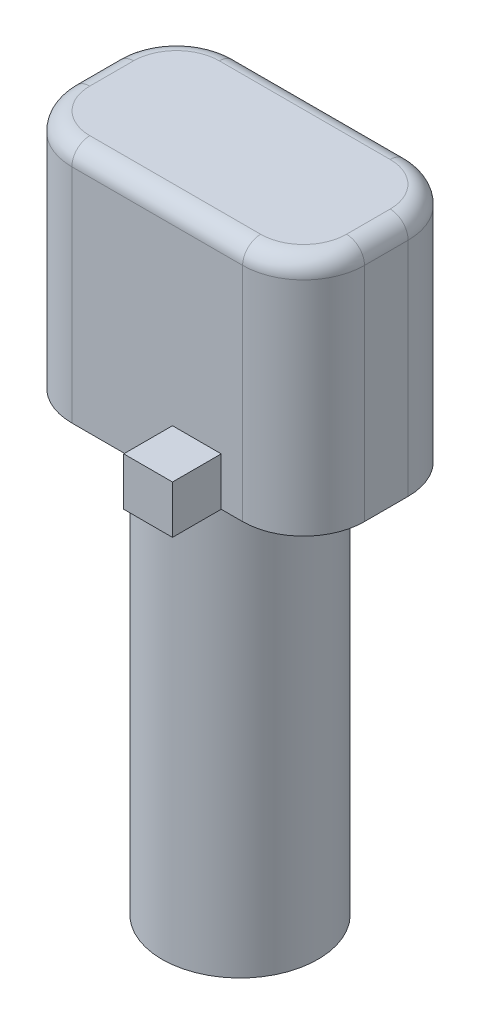
ISO-10303-21;
HEADER;
FILE_DESCRIPTION(('STEP AP214'),'2;1');
FILE_NAME('part.step','',(''),(''),'','','');
FILE_SCHEMA(('AUTOMOTIVE_DESIGN { 1 0 10303 214 1 1 1 1 }'));
ENDSEC;
DATA;
#1=APPLICATION_CONTEXT('core data for automotive mechanical design processes');
#2=APPLICATION_PROTOCOL_DEFINITION('international standard','automotive_design',2000,#1);
#3=PRODUCT_CONTEXT('',#1,'mechanical');
#4=PRODUCT('Part','Part','',(#3));
#5=PRODUCT_RELATED_PRODUCT_CATEGORY('part','',(#4));
#6=PRODUCT_DEFINITION_FORMATION('','',#4);
#7=PRODUCT_DEFINITION_CONTEXT('part definition',#1,'design');
#8=PRODUCT_DEFINITION('design','',#6,#7);
#9=PRODUCT_DEFINITION_SHAPE('','',#8);
#10=(LENGTH_UNIT() NAMED_UNIT(*) SI_UNIT(.MILLI.,.METRE.));
#11=(NAMED_UNIT(*) PLANE_ANGLE_UNIT() SI_UNIT($,.RADIAN.));
#12=(NAMED_UNIT(*) SI_UNIT($,.STERADIAN.) SOLID_ANGLE_UNIT());
#13=UNCERTAINTY_MEASURE_WITH_UNIT(LENGTH_MEASURE(1.E-05),#10,'distance_accuracy_value','');
#14=(GEOMETRIC_REPRESENTATION_CONTEXT(3) GLOBAL_UNCERTAINTY_ASSIGNED_CONTEXT((#13)) GLOBAL_UNIT_ASSIGNED_CONTEXT((#10,
#11,#12)) REPRESENTATION_CONTEXT('',''));
#15=CARTESIAN_POINT('',(0.,0.,0.));
#16=DIRECTION('',(0.,0.,1.));
#17=DIRECTION('',(1.,0.,0.));
#18=AXIS2_PLACEMENT_3D('',#15,#16,#17);
#19=CARTESIAN_POINT('',(0.,17.686,0.));
#20=DIRECTION('',(0.,-1.,0.));
#21=DIRECTION('',(0.,0.,-1.));
#22=AXIS2_PLACEMENT_3D('',#19,#20,#21);
#23=CYLINDRICAL_SURFACE('',#22,3.25);
#24=CARTESIAN_POINT('',(0.,17.686,0.));
#25=DIRECTION('',(0.,1.,0.));
#26=DIRECTION('',(0.,0.,1.));
#27=AXIS2_PLACEMENT_3D('',#24,#25,#26);
#28=CIRCLE('',#27,3.25);
#29=CARTESIAN_POINT('',(0.,17.686,3.25));
#30=VERTEX_POINT('',#29);
#31=EDGE_CURVE('E290',#30,#30,#28,.T.);
#32=ORIENTED_EDGE('',*,*,#31,.F.);
#33=EDGE_LOOP('',(#32));
#34=FACE_BOUND('',#33,.T.);
#35=CARTESIAN_POINT('',(0.,0.,0.));
#36=DIRECTION('',(0.,1.,0.));
#37=DIRECTION('',(0.,0.,1.));
#38=AXIS2_PLACEMENT_3D('',#35,#36,#37);
#39=CIRCLE('',#38,3.25);
#40=CARTESIAN_POINT('',(0.,0.,3.25));
#41=VERTEX_POINT('',#40);
#42=EDGE_CURVE('E289',#41,#41,#39,.T.);
#43=ORIENTED_EDGE('',*,*,#42,.T.);
#44=EDGE_LOOP('',(#43));
#45=FACE_BOUND('',#44,.T.);
#46=ADVANCED_FACE('F47',(#34,#45),#23,.T.);
#47=CARTESIAN_POINT('',(0.,0.,0.));
#48=DIRECTION('',(0.,1.,0.));
#49=DIRECTION('',(0.,0.,1.));
#50=AXIS2_PLACEMENT_3D('',#47,#48,#49);
#51=PLANE('',#50);
#52=ORIENTED_EDGE('',*,*,#42,.F.);
#53=EDGE_LOOP('',(#52));
#54=FACE_BOUND('',#53,.T.);
#55=ADVANCED_FACE('F501',(#54),#51,.F.);
#56=CARTESIAN_POINT('',(6.1,27.686,-3.45));
#57=DIRECTION('',(-1.,0.,0.));
#58=DIRECTION('',(0.,0.,1.));
#59=AXIS2_PLACEMENT_3D('',#56,#57,#58);
#60=PLANE('',#59);
#61=DIRECTION('',(0.,-1.,0.));
#62=VECTOR('',#61,1.);
#63=CARTESIAN_POINT('',(6.1,27.686,-0.909999999999999));
#64=LINE('',#63,#62);
#65=CARTESIAN_POINT('',(6.1,17.686,-0.909999999999999));
#66=VERTEX_POINT('',#65);
#67=CARTESIAN_POINT('',(6.1,26.936,-0.909999999999999));
#68=VERTEX_POINT('',#67);
#69=EDGE_CURVE('E328',#66,#68,#64,.F.);
#70=ORIENTED_EDGE('',*,*,#69,.T.);
#71=DIRECTION('',(0.,0.,-1.));
#72=VECTOR('',#71,1.);
#73=CARTESIAN_POINT('',(6.1,26.936,0.910000000000001));
#74=LINE('',#73,#72);
#75=CARTESIAN_POINT('',(6.1,26.936,0.910000000000001));
#76=VERTEX_POINT('',#75);
#77=EDGE_CURVE('E364',#68,#76,#74,.F.);
#78=ORIENTED_EDGE('',*,*,#77,.T.);
#79=DIRECTION('',(0.,-1.,0.));
#80=VECTOR('',#79,1.);
#81=CARTESIAN_POINT('',(6.1,27.686,0.910000000000001));
#82=LINE('',#81,#80);
#83=CARTESIAN_POINT('',(6.1,17.686,0.910000000000001));
#84=VERTEX_POINT('',#83);
#85=EDGE_CURVE('E325',#76,#84,#82,.T.);
#86=ORIENTED_EDGE('',*,*,#85,.T.);
#87=DIRECTION('',(0.,0.,-1.));
#88=VECTOR('',#87,1.);
#89=CARTESIAN_POINT('',(6.1,17.686,-3.45));
#90=LINE('',#89,#88);
#91=EDGE_CURVE('E273',#84,#66,#90,.T.);
#92=ORIENTED_EDGE('',*,*,#91,.T.);
#93=EDGE_LOOP('',(#70,#78,#86,#92));
#94=FACE_BOUND('',#93,.T.);
#95=ADVANCED_FACE('F483',(#94),#60,.F.);
#96=CARTESIAN_POINT('',(-6.1,27.686,-3.45));
#97=DIRECTION('',(0.,0.,1.));
#98=DIRECTION('',(1.,0.,0.));
#99=AXIS2_PLACEMENT_3D('',#96,#97,#98);
#100=PLANE('',#99);
#101=DIRECTION('',(-1.,0.,0.));
#102=VECTOR('',#101,1.);
#103=CARTESIAN_POINT('',(-3.302,19.686,-3.45));
#104=LINE('',#103,#102);
#105=CARTESIAN_POINT('',(-1.27,19.686,-3.45));
#106=VERTEX_POINT('',#105);
#107=CARTESIAN_POINT('',(-3.302,19.686,-3.45));
#108=VERTEX_POINT('',#107);
#109=EDGE_CURVE('E65',#106,#108,#104,.T.);
#110=ORIENTED_EDGE('',*,*,#109,.T.);
#111=DIRECTION('',(0.,-1.,0.));
#112=VECTOR('',#111,1.);
#113=CARTESIAN_POINT('',(-3.302,19.686,-3.45));
#114=LINE('',#113,#112);
#115=CARTESIAN_POINT('',(-3.302,17.686,-3.45));
#116=VERTEX_POINT('',#115);
#117=EDGE_CURVE('E208',#108,#116,#114,.T.);
#118=ORIENTED_EDGE('',*,*,#117,.T.);
#119=DIRECTION('',(-1.,0.,0.));
#120=VECTOR('',#119,1.);
#121=CARTESIAN_POINT('',(-6.1,17.686,-3.45));
#122=LINE('',#121,#120);
#123=CARTESIAN_POINT('',(-3.56,17.686,-3.45));
#124=VERTEX_POINT('',#123);
#125=EDGE_CURVE('E277',#116,#124,#122,.T.);
#126=ORIENTED_EDGE('',*,*,#125,.T.);
#127=DIRECTION('',(0.,-1.,0.));
#128=VECTOR('',#127,1.);
#129=CARTESIAN_POINT('',(-3.56,27.686,-3.45));
#130=LINE('',#129,#128);
#131=CARTESIAN_POINT('',(-3.56,26.936,-3.45));
#132=VERTEX_POINT('',#131);
#133=EDGE_CURVE('E321',#124,#132,#130,.F.);
#134=ORIENTED_EDGE('',*,*,#133,.T.);
#135=DIRECTION('',(-1.,0.,0.));
#136=VECTOR('',#135,1.);
#137=CARTESIAN_POINT('',(3.56,26.936,-3.45));
#138=LINE('',#137,#136);
#139=CARTESIAN_POINT('',(3.56,26.936,-3.45));
#140=VERTEX_POINT('',#139);
#141=EDGE_CURVE('E374',#132,#140,#138,.F.);
#142=ORIENTED_EDGE('',*,*,#141,.T.);
#143=DIRECTION('',(0.,-1.,0.));
#144=VECTOR('',#143,1.);
#145=CARTESIAN_POINT('',(3.56,27.686,-3.45));
#146=LINE('',#145,#144);
#147=CARTESIAN_POINT('',(3.56,17.686,-3.45));
#148=VERTEX_POINT('',#147);
#149=EDGE_CURVE('E318',#140,#148,#146,.T.);
#150=ORIENTED_EDGE('',*,*,#149,.T.);
#151=CARTESIAN_POINT('',(-1.27,17.686,-3.45));
#152=VERTEX_POINT('',#151);
#153=EDGE_CURVE('E278',#148,#152,#122,.T.);
#154=ORIENTED_EDGE('',*,*,#153,.T.);
#155=DIRECTION('',(0.,-1.,0.));
#156=VECTOR('',#155,1.);
#157=CARTESIAN_POINT('',(-1.27,19.686,-3.45));
#158=LINE('',#157,#156);
#159=EDGE_CURVE('E70',#106,#152,#158,.T.);
#160=ORIENTED_EDGE('',*,*,#159,.F.);
#161=EDGE_LOOP('',(#110,#118,#126,#134,#142,#150,#154,#160));
#162=FACE_BOUND('',#161,.T.);
#163=ADVANCED_FACE('F464',(#162),#100,.F.);
#164=CARTESIAN_POINT('',(-6.1,27.686,-3.45));
#165=DIRECTION('',(1.,0.,0.));
#166=DIRECTION('',(0.,0.,-1.));
#167=AXIS2_PLACEMENT_3D('',#164,#165,#166);
#168=PLANE('',#167);
#169=DIRECTION('',(0.,-1.,0.));
#170=VECTOR('',#169,1.);
#171=CARTESIAN_POINT('',(-6.1,27.686,0.910000000000001));
#172=LINE('',#171,#170);
#173=CARTESIAN_POINT('',(-6.1,17.686,0.910000000000001));
#174=VERTEX_POINT('',#173);
#175=CARTESIAN_POINT('',(-6.1,26.936,0.910000000000001));
#176=VERTEX_POINT('',#175);
#177=EDGE_CURVE('E294',#174,#176,#172,.F.);
#178=ORIENTED_EDGE('',*,*,#177,.T.);
#179=DIRECTION('',(0.,0.,1.));
#180=VECTOR('',#179,1.);
#181=CARTESIAN_POINT('',(-6.1,26.936,-0.909999999999998));
#182=LINE('',#181,#180);
#183=CARTESIAN_POINT('',(-6.1,26.936,-0.909999999999998));
#184=VERTEX_POINT('',#183);
#185=EDGE_CURVE('E380',#176,#184,#182,.F.);
#186=ORIENTED_EDGE('',*,*,#185,.T.);
#187=DIRECTION('',(0.,-1.,0.));
#188=VECTOR('',#187,1.);
#189=CARTESIAN_POINT('',(-6.1,27.686,-0.909999999999998));
#190=LINE('',#189,#188);
#191=CARTESIAN_POINT('',(-6.1,17.686,-0.909999999999998));
#192=VERTEX_POINT('',#191);
#193=EDGE_CURVE('E301',#184,#192,#190,.T.);
#194=ORIENTED_EDGE('',*,*,#193,.T.);
#195=DIRECTION('',(0.,0.,1.));
#196=VECTOR('',#195,1.);
#197=CARTESIAN_POINT('',(-6.1,17.686,-3.45));
#198=LINE('',#197,#196);
#199=EDGE_CURVE('E281',#192,#174,#198,.T.);
#200=ORIENTED_EDGE('',*,*,#199,.T.);
#201=EDGE_LOOP('',(#178,#186,#194,#200));
#202=FACE_BOUND('',#201,.T.);
#203=ADVANCED_FACE('F425',(#202),#168,.F.);
#204=CARTESIAN_POINT('',(-6.1,27.686,3.45));
#205=DIRECTION('',(0.,0.,-1.));
#206=DIRECTION('',(-1.,0.,0.));
#207=AXIS2_PLACEMENT_3D('',#204,#205,#206);
#208=PLANE('',#207);
#209=DIRECTION('',(1.,0.,0.));
#210=VECTOR('',#209,1.);
#211=CARTESIAN_POINT('',(2.667,19.686,3.45));
#212=LINE('',#211,#210);
#213=CARTESIAN_POINT('',(0.634999999999998,19.686,3.45));
#214=VERTEX_POINT('',#213);
#215=CARTESIAN_POINT('',(2.667,19.686,3.45));
#216=VERTEX_POINT('',#215);
#217=EDGE_CURVE('E236',#214,#216,#212,.T.);
#218=ORIENTED_EDGE('',*,*,#217,.T.);
#219=DIRECTION('',(0.,-1.,0.));
#220=VECTOR('',#219,1.);
#221=CARTESIAN_POINT('',(2.667,19.686,3.45));
#222=LINE('',#221,#220);
#223=CARTESIAN_POINT('',(2.667,17.686,3.45));
#224=VERTEX_POINT('',#223);
#225=EDGE_CURVE('E244',#216,#224,#222,.T.);
#226=ORIENTED_EDGE('',*,*,#225,.T.);
#227=DIRECTION('',(1.,0.,0.));
#228=VECTOR('',#227,1.);
#229=CARTESIAN_POINT('',(-6.1,17.686,3.45));
#230=LINE('',#229,#228);
#231=CARTESIAN_POINT('',(3.56,17.686,3.45));
#232=VERTEX_POINT('',#231);
#233=EDGE_CURVE('E285',#224,#232,#230,.T.);
#234=ORIENTED_EDGE('',*,*,#233,.T.);
#235=DIRECTION('',(0.,-1.,0.));
#236=VECTOR('',#235,1.);
#237=CARTESIAN_POINT('',(3.56,27.686,3.45));
#238=LINE('',#237,#236);
#239=CARTESIAN_POINT('',(3.56,26.936,3.45));
#240=VERTEX_POINT('',#239);
#241=EDGE_CURVE('E335',#232,#240,#238,.F.);
#242=ORIENTED_EDGE('',*,*,#241,.T.);
#243=DIRECTION('',(1.,0.,0.));
#244=VECTOR('',#243,1.);
#245=CARTESIAN_POINT('',(-3.56,26.936,3.45));
#246=LINE('',#245,#244);
#247=CARTESIAN_POINT('',(-3.56,26.936,3.45));
#248=VERTEX_POINT('',#247);
#249=EDGE_CURVE('E11',#240,#248,#246,.F.);
#250=ORIENTED_EDGE('',*,*,#249,.T.);
#251=DIRECTION('',(0.,-1.,0.));
#252=VECTOR('',#251,1.);
#253=CARTESIAN_POINT('',(-3.56,27.686,3.45));
#254=LINE('',#253,#252);
#255=CARTESIAN_POINT('',(-3.56,17.686,3.45));
#256=VERTEX_POINT('',#255);
#257=EDGE_CURVE('E332',#248,#256,#254,.T.);
#258=ORIENTED_EDGE('',*,*,#257,.T.);
#259=CARTESIAN_POINT('',(0.634999999999999,17.686,3.45));
#260=VERTEX_POINT('',#259);
#261=EDGE_CURVE('E286',#256,#260,#230,.T.);
#262=ORIENTED_EDGE('',*,*,#261,.T.);
#263=DIRECTION('',(0.,-1.,0.));
#264=VECTOR('',#263,1.);
#265=CARTESIAN_POINT('',(0.634999999999999,19.686,3.45));
#266=LINE('',#265,#264);
#267=EDGE_CURVE('E240',#214,#260,#266,.T.);
#268=ORIENTED_EDGE('',*,*,#267,.F.);
#269=EDGE_LOOP('',(#218,#226,#234,#242,#250,#258,#262,#268));
#270=FACE_BOUND('',#269,.T.);
#271=ADVANCED_FACE('F440',(#270),#208,.F.);
#272=CARTESIAN_POINT('',(0.,27.686,0.));
#273=DIRECTION('',(0.,1.,0.));
#274=DIRECTION('',(0.,0.,1.));
#275=AXIS2_PLACEMENT_3D('',#272,#273,#274);
#276=PLANE('',#275);
#277=CARTESIAN_POINT('',(3.56,27.686,0.910000000000001));
#278=DIRECTION('',(0.,1.,0.));
#279=DIRECTION('',(0.,0.,1.));
#280=AXIS2_PLACEMENT_3D('',#277,#278,#279);
#281=CIRCLE('',#280,1.79);
#282=CARTESIAN_POINT('',(3.56,27.686,2.7));
#283=VERTEX_POINT('',#282);
#284=CARTESIAN_POINT('',(5.35,27.686,0.910000000000001));
#285=VERTEX_POINT('',#284);
#286=EDGE_CURVE('E357',#283,#285,#281,.T.);
#287=ORIENTED_EDGE('',*,*,#286,.T.);
#288=DIRECTION('',(0.,0.,-1.));
#289=VECTOR('',#288,1.);
#290=CARTESIAN_POINT('',(5.35,27.686,-0.909999999999999));
#291=LINE('',#290,#289);
#292=CARTESIAN_POINT('',(5.35,27.686,-0.909999999999999));
#293=VERTEX_POINT('',#292);
#294=EDGE_CURVE('E360',#285,#293,#291,.T.);
#295=ORIENTED_EDGE('',*,*,#294,.T.);
#296=CARTESIAN_POINT('',(3.56,27.686,-0.909999999999999));
#297=DIRECTION('',(0.,1.,0.));
#298=DIRECTION('',(0.,0.,1.));
#299=AXIS2_PLACEMENT_3D('',#296,#297,#298);
#300=CIRCLE('',#299,1.79);
#301=CARTESIAN_POINT('',(3.56,27.686,-2.7));
#302=VERTEX_POINT('',#301);
#303=EDGE_CURVE('E354',#293,#302,#300,.T.);
#304=ORIENTED_EDGE('',*,*,#303,.T.);
#305=DIRECTION('',(-1.,0.,0.));
#306=VECTOR('',#305,1.);
#307=CARTESIAN_POINT('',(-3.56,27.686,-2.7));
#308=LINE('',#307,#306);
#309=CARTESIAN_POINT('',(-3.56,27.686,-2.7));
#310=VERTEX_POINT('',#309);
#311=EDGE_CURVE('E351',#302,#310,#308,.T.);
#312=ORIENTED_EDGE('',*,*,#311,.T.);
#313=CARTESIAN_POINT('',(-3.56,27.686,-0.909999999999999));
#314=DIRECTION('',(0.,1.,0.));
#315=DIRECTION('',(0.,0.,1.));
#316=AXIS2_PLACEMENT_3D('',#313,#314,#315);
#317=CIRCLE('',#316,1.79);
#318=CARTESIAN_POINT('',(-5.35,27.686,-0.909999999999999));
#319=VERTEX_POINT('',#318);
#320=EDGE_CURVE('E348',#310,#319,#317,.T.);
#321=ORIENTED_EDGE('',*,*,#320,.T.);
#322=DIRECTION('',(0.,0.,1.));
#323=VECTOR('',#322,1.);
#324=CARTESIAN_POINT('',(-5.35,27.686,0.910000000000001));
#325=LINE('',#324,#323);
#326=CARTESIAN_POINT('',(-5.35,27.686,0.910000000000001));
#327=VERTEX_POINT('',#326);
#328=EDGE_CURVE('E345',#319,#327,#325,.T.);
#329=ORIENTED_EDGE('',*,*,#328,.T.);
#330=CARTESIAN_POINT('',(-3.56,27.686,0.910000000000001));
#331=DIRECTION('',(0.,1.,0.));
#332=DIRECTION('',(0.,0.,1.));
#333=AXIS2_PLACEMENT_3D('',#330,#331,#332);
#334=CIRCLE('',#333,1.79);
#335=CARTESIAN_POINT('',(-3.56,27.686,2.7));
#336=VERTEX_POINT('',#335);
#337=EDGE_CURVE('E342',#327,#336,#334,.T.);
#338=ORIENTED_EDGE('',*,*,#337,.T.);
#339=DIRECTION('',(1.,0.,0.));
#340=VECTOR('',#339,1.);
#341=CARTESIAN_POINT('',(3.56,27.686,2.7));
#342=LINE('',#341,#340);
#343=EDGE_CURVE('E339',#336,#283,#342,.T.);
#344=ORIENTED_EDGE('',*,*,#343,.T.);
#345=EDGE_LOOP('',(#287,#295,#304,#312,#321,#329,#338,#344));
#346=FACE_BOUND('',#345,.T.);
#347=ADVANCED_FACE('F454',(#346),#276,.T.);
#348=CARTESIAN_POINT('',(0.,17.686,0.));
#349=DIRECTION('',(0.,1.,0.));
#350=DIRECTION('',(0.,0.,1.));
#351=AXIS2_PLACEMENT_3D('',#348,#349,#350);
#352=PLANE('',#351);
#353=ORIENTED_EDGE('',*,*,#31,.T.);
#354=EDGE_LOOP('',(#353));
#355=FACE_BOUND('',#354,.T.);
#356=ORIENTED_EDGE('',*,*,#199,.F.);
#357=CARTESIAN_POINT('',(-3.56,17.686,-0.909999999999999));
#358=DIRECTION('',(0.,1.,0.));
#359=DIRECTION('',(0.,0.,1.));
#360=AXIS2_PLACEMENT_3D('',#357,#358,#359);
#361=CIRCLE('',#360,2.54);
#362=EDGE_CURVE('E314',#192,#124,#361,.F.);
#363=ORIENTED_EDGE('',*,*,#362,.T.);
#364=ORIENTED_EDGE('',*,*,#125,.F.);
#365=DIRECTION('',(0.,0.,-1.));
#366=VECTOR('',#365,1.);
#367=CARTESIAN_POINT('',(-3.302,17.686,-5.482));
#368=LINE('',#367,#366);
#369=CARTESIAN_POINT('',(-3.302,17.686,-5.482));
#370=VERTEX_POINT('',#369);
#371=EDGE_CURVE('E220',#116,#370,#368,.T.);
#372=ORIENTED_EDGE('',*,*,#371,.T.);
#373=DIRECTION('',(1.,0.,0.));
#374=VECTOR('',#373,1.);
#375=CARTESIAN_POINT('',(-1.27,17.686,-5.482));
#376=LINE('',#375,#374);
#377=CARTESIAN_POINT('',(-1.27,17.686,-5.482));
#378=VERTEX_POINT('',#377);
#379=EDGE_CURVE('E191',#370,#378,#376,.T.);
#380=ORIENTED_EDGE('',*,*,#379,.T.);
#381=DIRECTION('',(0.,0.,1.));
#382=VECTOR('',#381,1.);
#383=CARTESIAN_POINT('',(-1.27,17.686,-3.45));
#384=LINE('',#383,#382);
#385=EDGE_CURVE('E210',#378,#152,#384,.T.);
#386=ORIENTED_EDGE('',*,*,#385,.T.);
#387=ORIENTED_EDGE('',*,*,#153,.F.);
#388=CARTESIAN_POINT('',(3.56,17.686,-0.909999999999999));
#389=DIRECTION('',(0.,1.,0.));
#390=DIRECTION('',(0.,0.,1.));
#391=AXIS2_PLACEMENT_3D('',#388,#389,#390);
#392=CIRCLE('',#391,2.54);
#393=EDGE_CURVE('E311',#148,#66,#392,.F.);
#394=ORIENTED_EDGE('',*,*,#393,.T.);
#395=ORIENTED_EDGE('',*,*,#91,.F.);
#396=CARTESIAN_POINT('',(3.56,17.686,0.910000000000001));
#397=DIRECTION('',(0.,1.,0.));
#398=DIRECTION('',(0.,0.,1.));
#399=AXIS2_PLACEMENT_3D('',#396,#397,#398);
#400=CIRCLE('',#399,2.54);
#401=EDGE_CURVE('E307',#84,#232,#400,.F.);
#402=ORIENTED_EDGE('',*,*,#401,.T.);
#403=ORIENTED_EDGE('',*,*,#233,.F.);
#404=DIRECTION('',(0.,0.,1.));
#405=VECTOR('',#404,1.);
#406=CARTESIAN_POINT('',(2.667,17.686,3.45));
#407=LINE('',#406,#405);
#408=CARTESIAN_POINT('',(2.667,17.686,5.482));
#409=VERTEX_POINT('',#408);
#410=EDGE_CURVE('E223',#224,#409,#407,.T.);
#411=ORIENTED_EDGE('',*,*,#410,.T.);
#412=DIRECTION('',(-1.,0.,0.));
#413=VECTOR('',#412,1.);
#414=CARTESIAN_POINT('',(2.667,17.686,5.482));
#415=LINE('',#414,#413);
#416=CARTESIAN_POINT('',(0.634999999999999,17.686,5.482));
#417=VERTEX_POINT('',#416);
#418=EDGE_CURVE('E252',#409,#417,#415,.T.);
#419=ORIENTED_EDGE('',*,*,#418,.T.);
#420=DIRECTION('',(0.,0.,-1.));
#421=VECTOR('',#420,1.);
#422=CARTESIAN_POINT('',(0.634999999999999,17.686,5.482));
#423=LINE('',#422,#421);
#424=EDGE_CURVE('E248',#417,#260,#423,.T.);
#425=ORIENTED_EDGE('',*,*,#424,.T.);
#426=ORIENTED_EDGE('',*,*,#261,.F.);
#427=CARTESIAN_POINT('',(-3.56,17.686,0.910000000000001));
#428=DIRECTION('',(0.,1.,0.));
#429=DIRECTION('',(0.,0.,1.));
#430=AXIS2_PLACEMENT_3D('',#427,#428,#429);
#431=CIRCLE('',#430,2.54);
#432=EDGE_CURVE('E304',#256,#174,#431,.F.);
#433=ORIENTED_EDGE('',*,*,#432,.T.);
#434=EDGE_LOOP('',(#356,#363,#364,#372,#380,#386,#387,#394,#395,#402,#403,#411,#419,#425,#426,#433));
#435=FACE_BOUND('',#434,.T.);
#436=ADVANCED_FACE('F433',(#355,#435),#352,.F.);
#437=CARTESIAN_POINT('',(-3.56,27.686,-0.909999999999999));
#438=DIRECTION('',(0.,-1.,0.));
#439=DIRECTION('',(0.,0.,-1.));
#440=AXIS2_PLACEMENT_3D('',#437,#438,#439);
#441=CYLINDRICAL_SURFACE('',#440,2.54);
#442=ORIENTED_EDGE('',*,*,#193,.F.);
#443=CARTESIAN_POINT('',(-3.56,26.936,-0.909999999999999));
#444=DIRECTION('',(0.,1.,0.));
#445=DIRECTION('',(0.,0.,1.));
#446=AXIS2_PLACEMENT_3D('',#443,#444,#445);
#447=CIRCLE('',#446,2.54);
#448=EDGE_CURVE('E377',#184,#132,#447,.F.);
#449=ORIENTED_EDGE('',*,*,#448,.T.);
#450=ORIENTED_EDGE('',*,*,#133,.F.);
#451=ORIENTED_EDGE('',*,*,#362,.F.);
#452=EDGE_LOOP('',(#442,#449,#450,#451));
#453=FACE_BOUND('',#452,.T.);
#454=ADVANCED_FACE('F429',(#453),#441,.T.);
#455=CARTESIAN_POINT('',(3.56,27.686,-0.909999999999999));
#456=DIRECTION('',(0.,-1.,0.));
#457=DIRECTION('',(0.,0.,-1.));
#458=AXIS2_PLACEMENT_3D('',#455,#456,#457);
#459=CYLINDRICAL_SURFACE('',#458,2.54);
#460=ORIENTED_EDGE('',*,*,#149,.F.);
#461=CARTESIAN_POINT('',(3.56,26.936,-0.909999999999999));
#462=DIRECTION('',(0.,1.,0.));
#463=DIRECTION('',(0.,0.,1.));
#464=AXIS2_PLACEMENT_3D('',#461,#462,#463);
#465=CIRCLE('',#464,2.54);
#466=EDGE_CURVE('E371',#140,#68,#465,.F.);
#467=ORIENTED_EDGE('',*,*,#466,.T.);
#468=ORIENTED_EDGE('',*,*,#69,.F.);
#469=ORIENTED_EDGE('',*,*,#393,.F.);
#470=EDGE_LOOP('',(#460,#467,#468,#469));
#471=FACE_BOUND('',#470,.T.);
#472=ADVANCED_FACE('F467',(#471),#459,.T.);
#473=CARTESIAN_POINT('',(3.56,27.686,0.910000000000001));
#474=DIRECTION('',(0.,-1.,0.));
#475=DIRECTION('',(0.,0.,-1.));
#476=AXIS2_PLACEMENT_3D('',#473,#474,#475);
#477=CYLINDRICAL_SURFACE('',#476,2.54);
#478=ORIENTED_EDGE('',*,*,#85,.F.);
#479=CARTESIAN_POINT('',(3.56,26.936,0.910000000000001));
#480=DIRECTION('',(0.,1.,0.));
#481=DIRECTION('',(0.,0.,1.));
#482=AXIS2_PLACEMENT_3D('',#479,#480,#481);
#483=CIRCLE('',#482,2.54);
#484=EDGE_CURVE('E368',#76,#240,#483,.F.);
#485=ORIENTED_EDGE('',*,*,#484,.T.);
#486=ORIENTED_EDGE('',*,*,#241,.F.);
#487=ORIENTED_EDGE('',*,*,#401,.F.);
#488=EDGE_LOOP('',(#478,#485,#486,#487));
#489=FACE_BOUND('',#488,.T.);
#490=ADVANCED_FACE('F481',(#489),#477,.T.);
#491=CARTESIAN_POINT('',(-3.56,27.686,0.910000000000001));
#492=DIRECTION('',(0.,-1.,0.));
#493=DIRECTION('',(0.,0.,-1.));
#494=AXIS2_PLACEMENT_3D('',#491,#492,#493);
#495=CYLINDRICAL_SURFACE('',#494,2.54);
#496=ORIENTED_EDGE('',*,*,#257,.F.);
#497=CARTESIAN_POINT('',(-3.56,26.936,0.910000000000001));
#498=DIRECTION('',(0.,1.,0.));
#499=DIRECTION('',(0.,0.,1.));
#500=AXIS2_PLACEMENT_3D('',#497,#498,#499);
#501=CIRCLE('',#500,2.54);
#502=EDGE_CURVE('E57',#248,#176,#501,.F.);
#503=ORIENTED_EDGE('',*,*,#502,.T.);
#504=ORIENTED_EDGE('',*,*,#177,.F.);
#505=ORIENTED_EDGE('',*,*,#432,.F.);
#506=EDGE_LOOP('',(#496,#503,#504,#505));
#507=FACE_BOUND('',#506,.T.);
#508=ADVANCED_FACE('F438',(#507),#495,.T.);
#509=CARTESIAN_POINT('',(-5.35,26.936,0.));
#510=DIRECTION('',(0.,0.,-1.));
#511=DIRECTION('',(-1.,0.,0.));
#512=AXIS2_PLACEMENT_3D('',#509,#510,#511);
#513=CYLINDRICAL_SURFACE('',#512,0.75);
#514=CARTESIAN_POINT('',(-5.35,26.936,-0.909999999999999));
#515=DIRECTION('',(0.,0.,-1.));
#516=DIRECTION('',(-1.,0.,0.));
#517=AXIS2_PLACEMENT_3D('',#514,#515,#516);
#518=CIRCLE('',#517,0.75);
#519=EDGE_CURVE('E405',#184,#319,#518,.T.);
#520=ORIENTED_EDGE('',*,*,#519,.F.);
#521=ORIENTED_EDGE('',*,*,#185,.F.);
#522=CARTESIAN_POINT('',(-5.35,26.936,0.910000000000001));
#523=DIRECTION('',(0.,0.,1.));
#524=DIRECTION('',(1.,0.,0.));
#525=AXIS2_PLACEMENT_3D('',#522,#523,#524);
#526=CIRCLE('',#525,0.75);
#527=EDGE_CURVE('E51',#327,#176,#526,.T.);
#528=ORIENTED_EDGE('',*,*,#527,.F.);
#529=ORIENTED_EDGE('',*,*,#328,.F.);
#530=EDGE_LOOP('',(#520,#521,#528,#529));
#531=FACE_BOUND('',#530,.T.);
#532=ADVANCED_FACE('F49',(#531),#513,.T.);
#533=CARTESIAN_POINT('',(-3.56,26.936,0.910000000000001));
#534=DIRECTION('',(0.,1.,0.));
#535=DIRECTION('',(0.,0.,1.));
#536=AXIS2_PLACEMENT_3D('',#533,#534,#535);
#537=TOROIDAL_SURFACE('',#536,1.79,0.75);
#538=ORIENTED_EDGE('',*,*,#527,.T.);
#539=ORIENTED_EDGE('',*,*,#502,.F.);
#540=CARTESIAN_POINT('',(-3.56,26.936,2.7));
#541=DIRECTION('',(1.,0.,0.));
#542=DIRECTION('',(0.,0.,-1.));
#543=AXIS2_PLACEMENT_3D('',#540,#541,#542);
#544=CIRCLE('',#543,0.75);
#545=EDGE_CURVE('E402',#336,#248,#544,.T.);
#546=ORIENTED_EDGE('',*,*,#545,.F.);
#547=ORIENTED_EDGE('',*,*,#337,.F.);
#548=EDGE_LOOP('',(#538,#539,#546,#547));
#549=FACE_BOUND('',#548,.T.);
#550=ADVANCED_FACE('F418',(#549),#537,.T.);
#551=CARTESIAN_POINT('',(-3.56,26.936,-0.909999999999999));
#552=DIRECTION('',(0.,1.,0.));
#553=DIRECTION('',(0.,0.,1.));
#554=AXIS2_PLACEMENT_3D('',#551,#552,#553);
#555=TOROIDAL_SURFACE('',#554,1.79,0.75);
#556=ORIENTED_EDGE('',*,*,#519,.T.);
#557=ORIENTED_EDGE('',*,*,#320,.F.);
#558=CARTESIAN_POINT('',(-3.56,26.936,-2.7));
#559=DIRECTION('',(1.,0.,0.));
#560=DIRECTION('',(0.,0.,-1.));
#561=AXIS2_PLACEMENT_3D('',#558,#559,#560);
#562=CIRCLE('',#561,0.75);
#563=EDGE_CURVE('E398',#132,#310,#562,.T.);
#564=ORIENTED_EDGE('',*,*,#563,.F.);
#565=ORIENTED_EDGE('',*,*,#448,.F.);
#566=EDGE_LOOP('',(#556,#557,#564,#565));
#567=FACE_BOUND('',#566,.T.);
#568=ADVANCED_FACE('F457',(#567),#555,.T.);
#569=CARTESIAN_POINT('',(0.,26.936,2.7));
#570=DIRECTION('',(-1.,0.,0.));
#571=DIRECTION('',(0.,0.,1.));
#572=AXIS2_PLACEMENT_3D('',#569,#570,#571);
#573=CYLINDRICAL_SURFACE('',#572,0.75);
#574=ORIENTED_EDGE('',*,*,#545,.T.);
#575=ORIENTED_EDGE('',*,*,#249,.F.);
#576=CARTESIAN_POINT('',(3.56,26.936,2.7));
#577=DIRECTION('',(1.,0.,0.));
#578=DIRECTION('',(0.,0.,-1.));
#579=AXIS2_PLACEMENT_3D('',#576,#577,#578);
#580=CIRCLE('',#579,0.75);
#581=EDGE_CURVE('E394',#283,#240,#580,.T.);
#582=ORIENTED_EDGE('',*,*,#581,.F.);
#583=ORIENTED_EDGE('',*,*,#343,.F.);
#584=EDGE_LOOP('',(#574,#575,#582,#583));
#585=FACE_BOUND('',#584,.T.);
#586=ADVANCED_FACE('F445',(#585),#573,.T.);
#587=CARTESIAN_POINT('',(0.,26.936,-2.7));
#588=DIRECTION('',(1.,0.,0.));
#589=DIRECTION('',(0.,0.,-1.));
#590=AXIS2_PLACEMENT_3D('',#587,#588,#589);
#591=CYLINDRICAL_SURFACE('',#590,0.75);
#592=ORIENTED_EDGE('',*,*,#563,.T.);
#593=ORIENTED_EDGE('',*,*,#311,.F.);
#594=CARTESIAN_POINT('',(3.56,26.936,-2.7));
#595=DIRECTION('',(1.,0.,0.));
#596=DIRECTION('',(0.,0.,-1.));
#597=AXIS2_PLACEMENT_3D('',#594,#595,#596);
#598=CIRCLE('',#597,0.75);
#599=EDGE_CURVE('E390',#140,#302,#598,.T.);
#600=ORIENTED_EDGE('',*,*,#599,.F.);
#601=ORIENTED_EDGE('',*,*,#141,.F.);
#602=EDGE_LOOP('',(#592,#593,#600,#601));
#603=FACE_BOUND('',#602,.T.);
#604=ADVANCED_FACE('F460',(#603),#591,.T.);
#605=CARTESIAN_POINT('',(3.56,26.936,0.910000000000001));
#606=DIRECTION('',(0.,1.,0.));
#607=DIRECTION('',(0.,0.,1.));
#608=AXIS2_PLACEMENT_3D('',#605,#606,#607);
#609=TOROIDAL_SURFACE('',#608,1.79,0.75);
#610=ORIENTED_EDGE('',*,*,#581,.T.);
#611=ORIENTED_EDGE('',*,*,#484,.F.);
#612=CARTESIAN_POINT('',(5.35,26.936,0.910000000000001));
#613=DIRECTION('',(0.,0.,-1.));
#614=DIRECTION('',(-1.,0.,0.));
#615=AXIS2_PLACEMENT_3D('',#612,#613,#614);
#616=CIRCLE('',#615,0.75);
#617=EDGE_CURVE('E387',#285,#76,#616,.T.);
#618=ORIENTED_EDGE('',*,*,#617,.F.);
#619=ORIENTED_EDGE('',*,*,#286,.F.);
#620=EDGE_LOOP('',(#610,#611,#618,#619));
#621=FACE_BOUND('',#620,.T.);
#622=ADVANCED_FACE('F450',(#621),#609,.T.);
#623=CARTESIAN_POINT('',(3.56,26.936,-0.909999999999999));
#624=DIRECTION('',(0.,1.,0.));
#625=DIRECTION('',(0.,0.,1.));
#626=AXIS2_PLACEMENT_3D('',#623,#624,#625);
#627=TOROIDAL_SURFACE('',#626,1.79,0.75);
#628=ORIENTED_EDGE('',*,*,#599,.T.);
#629=ORIENTED_EDGE('',*,*,#303,.F.);
#630=CARTESIAN_POINT('',(5.35,26.936,-0.909999999999999));
#631=DIRECTION('',(0.,0.,1.));
#632=DIRECTION('',(1.,0.,0.));
#633=AXIS2_PLACEMENT_3D('',#630,#631,#632);
#634=CIRCLE('',#633,0.75);
#635=EDGE_CURVE('E228',#68,#293,#634,.T.);
#636=ORIENTED_EDGE('',*,*,#635,.F.);
#637=ORIENTED_EDGE('',*,*,#466,.F.);
#638=EDGE_LOOP('',(#628,#629,#636,#637));
#639=FACE_BOUND('',#638,.T.);
#640=ADVANCED_FACE('F490',(#639),#627,.T.);
#641=CARTESIAN_POINT('',(5.35,26.936,0.));
#642=DIRECTION('',(0.,0.,1.));
#643=DIRECTION('',(1.,0.,0.));
#644=AXIS2_PLACEMENT_3D('',#641,#642,#643);
#645=CYLINDRICAL_SURFACE('',#644,0.75);
#646=ORIENTED_EDGE('',*,*,#617,.T.);
#647=ORIENTED_EDGE('',*,*,#77,.F.);
#648=ORIENTED_EDGE('',*,*,#635,.T.);
#649=ORIENTED_EDGE('',*,*,#294,.F.);
#650=EDGE_LOOP('',(#646,#647,#648,#649));
#651=FACE_BOUND('',#650,.T.);
#652=ADVANCED_FACE('F487',(#651),#645,.T.);
#653=CARTESIAN_POINT('',(2.667,19.686,3.45));
#654=DIRECTION('',(1.,0.,0.));
#655=DIRECTION('',(0.,0.,-1.));
#656=AXIS2_PLACEMENT_3D('',#653,#654,#655);
#657=PLANE('',#656);
#658=ORIENTED_EDGE('',*,*,#410,.F.);
#659=ORIENTED_EDGE('',*,*,#225,.F.);
#660=DIRECTION('',(0.,0.,1.));
#661=VECTOR('',#660,1.);
#662=CARTESIAN_POINT('',(2.667,19.686,3.45));
#663=LINE('',#662,#661);
#664=CARTESIAN_POINT('',(2.667,19.686,5.482));
#665=VERTEX_POINT('',#664);
#666=EDGE_CURVE('E253',#216,#665,#663,.T.);
#667=ORIENTED_EDGE('',*,*,#666,.T.);
#668=DIRECTION('',(0.,-1.,0.));
#669=VECTOR('',#668,1.);
#670=CARTESIAN_POINT('',(2.667,19.686,5.482));
#671=LINE('',#670,#669);
#672=EDGE_CURVE('E233',#665,#409,#671,.T.);
#673=ORIENTED_EDGE('',*,*,#672,.T.);
#674=EDGE_LOOP('',(#658,#659,#667,#673));
#675=FACE_BOUND('',#674,.T.);
#676=ADVANCED_FACE('F497',(#675),#657,.T.);
#677=CARTESIAN_POINT('',(0.634999999999999,19.686,5.482));
#678=DIRECTION('',(-1.,0.,0.));
#679=DIRECTION('',(0.,0.,1.));
#680=AXIS2_PLACEMENT_3D('',#677,#678,#679);
#681=PLANE('',#680);
#682=ORIENTED_EDGE('',*,*,#424,.F.);
#683=DIRECTION('',(0.,-1.,0.));
#684=VECTOR('',#683,1.);
#685=CARTESIAN_POINT('',(0.634999999999999,19.686,5.482));
#686=LINE('',#685,#684);
#687=CARTESIAN_POINT('',(0.634999999999999,19.686,5.482));
#688=VERTEX_POINT('',#687);
#689=EDGE_CURVE('E237',#688,#417,#686,.T.);
#690=ORIENTED_EDGE('',*,*,#689,.F.);
#691=DIRECTION('',(0.,0.,-1.));
#692=VECTOR('',#691,1.);
#693=CARTESIAN_POINT('',(0.634999999999999,19.686,5.482));
#694=LINE('',#693,#692);
#695=EDGE_CURVE('E262',#688,#214,#694,.T.);
#696=ORIENTED_EDGE('',*,*,#695,.T.);
#697=ORIENTED_EDGE('',*,*,#267,.T.);
#698=EDGE_LOOP('',(#682,#690,#696,#697));
#699=FACE_BOUND('',#698,.T.);
#700=ADVANCED_FACE('F583',(#699),#681,.T.);
#701=CARTESIAN_POINT('',(2.667,19.686,5.482));
#702=DIRECTION('',(0.,0.,1.));
#703=DIRECTION('',(1.,0.,0.));
#704=AXIS2_PLACEMENT_3D('',#701,#702,#703);
#705=PLANE('',#704);
#706=ORIENTED_EDGE('',*,*,#418,.F.);
#707=ORIENTED_EDGE('',*,*,#672,.F.);
#708=DIRECTION('',(-1.,0.,0.));
#709=VECTOR('',#708,1.);
#710=CARTESIAN_POINT('',(2.667,19.686,5.482));
#711=LINE('',#710,#709);
#712=EDGE_CURVE('E266',#665,#688,#711,.T.);
#713=ORIENTED_EDGE('',*,*,#712,.T.);
#714=ORIENTED_EDGE('',*,*,#689,.T.);
#715=EDGE_LOOP('',(#706,#707,#713,#714));
#716=FACE_BOUND('',#715,.T.);
#717=ADVANCED_FACE('F593',(#716),#705,.T.);
#718=CARTESIAN_POINT('',(0.,19.686,0.));
#719=DIRECTION('',(0.,-1.,0.));
#720=DIRECTION('',(0.,0.,-1.));
#721=AXIS2_PLACEMENT_3D('',#718,#719,#720);
#722=PLANE('',#721);
#723=ORIENTED_EDGE('',*,*,#666,.F.);
#724=ORIENTED_EDGE('',*,*,#217,.F.);
#725=ORIENTED_EDGE('',*,*,#695,.F.);
#726=ORIENTED_EDGE('',*,*,#712,.F.);
#727=EDGE_LOOP('',(#723,#724,#725,#726));
#728=FACE_BOUND('',#727,.T.);
#729=ADVANCED_FACE('F603',(#728),#722,.F.);
#730=CARTESIAN_POINT('',(-3.302,19.686,-5.482));
#731=DIRECTION('',(-1.,0.,0.));
#732=DIRECTION('',(0.,0.,1.));
#733=AXIS2_PLACEMENT_3D('',#730,#731,#732);
#734=PLANE('',#733);
#735=ORIENTED_EDGE('',*,*,#371,.F.);
#736=ORIENTED_EDGE('',*,*,#117,.F.);
#737=DIRECTION('',(0.,0.,-1.));
#738=VECTOR('',#737,1.);
#739=CARTESIAN_POINT('',(-3.302,19.686,-5.482));
#740=LINE('',#739,#738);
#741=CARTESIAN_POINT('',(-3.302,19.686,-5.482));
#742=VERTEX_POINT('',#741);
#743=EDGE_CURVE('E203',#108,#742,#740,.T.);
#744=ORIENTED_EDGE('',*,*,#743,.T.);
#745=DIRECTION('',(0.,-1.,0.));
#746=VECTOR('',#745,1.);
#747=CARTESIAN_POINT('',(-3.302,19.686,-5.482));
#748=LINE('',#747,#746);
#749=EDGE_CURVE('E186',#742,#370,#748,.T.);
#750=ORIENTED_EDGE('',*,*,#749,.T.);
#751=EDGE_LOOP('',(#735,#736,#744,#750));
#752=FACE_BOUND('',#751,.T.);
#753=ADVANCED_FACE('F207',(#752),#734,.T.);
#754=CARTESIAN_POINT('',(-1.27,19.686,-3.45));
#755=DIRECTION('',(1.,0.,0.));
#756=DIRECTION('',(0.,0.,-1.));
#757=AXIS2_PLACEMENT_3D('',#754,#755,#756);
#758=PLANE('',#757);
#759=ORIENTED_EDGE('',*,*,#385,.F.);
#760=DIRECTION('',(0.,-1.,0.));
#761=VECTOR('',#760,1.);
#762=CARTESIAN_POINT('',(-1.27,19.686,-5.482));
#763=LINE('',#762,#761);
#764=CARTESIAN_POINT('',(-1.27,19.686,-5.482));
#765=VERTEX_POINT('',#764);
#766=EDGE_CURVE('E197',#765,#378,#763,.T.);
#767=ORIENTED_EDGE('',*,*,#766,.F.);
#768=DIRECTION('',(0.,0.,1.));
#769=VECTOR('',#768,1.);
#770=CARTESIAN_POINT('',(-1.27,19.686,-3.45));
#771=LINE('',#770,#769);
#772=EDGE_CURVE('E204',#765,#106,#771,.T.);
#773=ORIENTED_EDGE('',*,*,#772,.T.);
#774=ORIENTED_EDGE('',*,*,#159,.T.);
#775=EDGE_LOOP('',(#759,#767,#773,#774));
#776=FACE_BOUND('',#775,.T.);
#777=ADVANCED_FACE('F473',(#776),#758,.T.);
#778=CARTESIAN_POINT('',(-1.27,19.686,-5.482));
#779=DIRECTION('',(0.,0.,-1.));
#780=DIRECTION('',(-1.,0.,0.));
#781=AXIS2_PLACEMENT_3D('',#778,#779,#780);
#782=PLANE('',#781);
#783=ORIENTED_EDGE('',*,*,#379,.F.);
#784=ORIENTED_EDGE('',*,*,#749,.F.);
#785=DIRECTION('',(1.,0.,0.));
#786=VECTOR('',#785,1.);
#787=CARTESIAN_POINT('',(-1.27,19.686,-5.482));
#788=LINE('',#787,#786);
#789=EDGE_CURVE('E189',#742,#765,#788,.T.);
#790=ORIENTED_EDGE('',*,*,#789,.T.);
#791=ORIENTED_EDGE('',*,*,#766,.T.);
#792=EDGE_LOOP('',(#783,#784,#790,#791));
#793=FACE_BOUND('',#792,.T.);
#794=ADVANCED_FACE('F188',(#793),#782,.T.);
#795=CARTESIAN_POINT('',(0.,19.686,0.));
#796=DIRECTION('',(0.,1.,0.));
#797=DIRECTION('',(0.,0.,1.));
#798=AXIS2_PLACEMENT_3D('',#795,#796,#797);
#799=PLANE('',#798);
#800=ORIENTED_EDGE('',*,*,#743,.F.);
#801=ORIENTED_EDGE('',*,*,#109,.F.);
#802=ORIENTED_EDGE('',*,*,#772,.F.);
#803=ORIENTED_EDGE('',*,*,#789,.F.);
#804=EDGE_LOOP('',(#800,#801,#802,#803));
#805=FACE_BOUND('',#804,.T.);
#806=ADVANCED_FACE('F202',(#805),#799,.T.);
#807=CLOSED_SHELL('',(#46,#55,#95,#163,#203,#271,#347,#436,#454,#472,#490,#508,#532,#550,#568,
#586,#604,#622,#640,#652,#676,#700,#717,#729,#753,#777,#794,#806));
#808=MANIFOLD_SOLID_BREP('B2',#807);
#809=ADVANCED_BREP_SHAPE_REPRESENTATION('',(#18,#808),#14);
#810=SHAPE_DEFINITION_REPRESENTATION(#9,#809);
ENDSEC;
END-ISO-10303-21;
